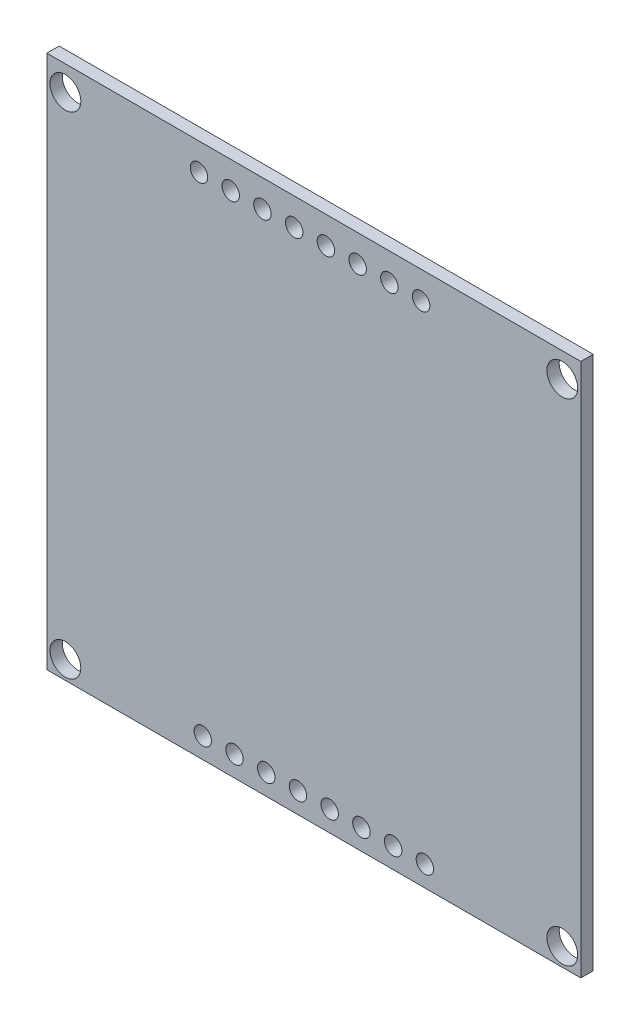
ISO-10303-21;
HEADER;
FILE_DESCRIPTION(('STEP AP214'),'2;1');
FILE_NAME('part.step','',(''),(''),'','','');
FILE_SCHEMA(('AUTOMOTIVE_DESIGN { 1 0 10303 214 1 1 1 1 }'));
ENDSEC;
DATA;
#1=APPLICATION_CONTEXT('core data for automotive mechanical design processes');
#2=APPLICATION_PROTOCOL_DEFINITION('international standard','automotive_design',2000,#1);
#3=PRODUCT_CONTEXT('',#1,'mechanical');
#4=PRODUCT('Part','Part','',(#3));
#5=PRODUCT_RELATED_PRODUCT_CATEGORY('part','',(#4));
#6=PRODUCT_DEFINITION_FORMATION('','',#4);
#7=PRODUCT_DEFINITION_CONTEXT('part definition',#1,'design');
#8=PRODUCT_DEFINITION('design','',#6,#7);
#9=PRODUCT_DEFINITION_SHAPE('','',#8);
#10=(LENGTH_UNIT() NAMED_UNIT(*) SI_UNIT(.MILLI.,.METRE.));
#11=(NAMED_UNIT(*) PLANE_ANGLE_UNIT() SI_UNIT($,.RADIAN.));
#12=(NAMED_UNIT(*) SI_UNIT($,.STERADIAN.) SOLID_ANGLE_UNIT());
#13=UNCERTAINTY_MEASURE_WITH_UNIT(LENGTH_MEASURE(1.E-05),#10,'distance_accuracy_value','');
#14=(GEOMETRIC_REPRESENTATION_CONTEXT(3) GLOBAL_UNCERTAINTY_ASSIGNED_CONTEXT((#13)) GLOBAL_UNIT_ASSIGNED_CONTEXT((#10,
#11,#12)) REPRESENTATION_CONTEXT('',''));
#15=CARTESIAN_POINT('',(0.,0.,0.));
#16=DIRECTION('',(0.,0.,1.));
#17=DIRECTION('',(1.,0.,0.));
#18=AXIS2_PLACEMENT_3D('',#15,#16,#17);
#19=CARTESIAN_POINT('',(0.,0.,1.));
#20=DIRECTION('',(0.,0.,-1.));
#21=DIRECTION('',(-1.,0.,0.));
#22=AXIS2_PLACEMENT_3D('',#19,#20,#21);
#23=PLANE('',#22);
#24=CARTESIAN_POINT('',(1.5,1.47673648000744,1.));
#25=DIRECTION('',(0.,0.,1.));
#26=DIRECTION('',(1.,0.,0.));
#27=AXIS2_PLACEMENT_3D('',#24,#25,#26);
#28=CIRCLE('',#27,1.25);
#29=CARTESIAN_POINT('',(2.75,1.47673648000744,1.));
#30=VERTEX_POINT('',#29);
#31=EDGE_CURVE('E218',#30,#30,#28,.T.);
#32=ORIENTED_EDGE('',*,*,#31,.F.);
#33=EDGE_LOOP('',(#32));
#34=FACE_BOUND('',#33,.T.);
#35=CARTESIAN_POINT('',(41.75,1.47673648000744,1.));
#36=DIRECTION('',(0.,0.,1.));
#37=DIRECTION('',(-1.,0.,0.));
#38=AXIS2_PLACEMENT_3D('',#35,#36,#37);
#39=CIRCLE('',#38,1.25);
#40=CARTESIAN_POINT('',(40.5,1.47673648000744,1.));
#41=VERTEX_POINT('',#40);
#42=EDGE_CURVE('E206',#41,#41,#39,.T.);
#43=ORIENTED_EDGE('',*,*,#42,.F.);
#44=EDGE_LOOP('',(#43));
#45=FACE_BOUND('',#44,.T.);
#46=CARTESIAN_POINT('',(20.34,1.67673648000722,1.));
#47=DIRECTION('',(0.,0.,1.));
#48=DIRECTION('',(-1.,0.,0.));
#49=AXIS2_PLACEMENT_3D('',#46,#47,#48);
#50=CIRCLE('',#49,0.707384328542562);
#51=CARTESIAN_POINT('',(19.6326156714574,1.67673648000722,1.));
#52=VERTEX_POINT('',#51);
#53=EDGE_CURVE('E194',#52,#52,#50,.T.);
#54=ORIENTED_EDGE('',*,*,#53,.F.);
#55=EDGE_LOOP('',(#54));
#56=FACE_BOUND('',#55,.T.);
#57=CARTESIAN_POINT('',(25.48,1.67673648000723,1.));
#58=DIRECTION('',(0.,0.,1.));
#59=DIRECTION('',(-1.,0.,0.));
#60=AXIS2_PLACEMENT_3D('',#57,#58,#59);
#61=CIRCLE('',#60,0.707384328542562);
#62=CARTESIAN_POINT('',(24.7726156714574,1.67673648000723,1.));
#63=VERTEX_POINT('',#62);
#64=EDGE_CURVE('E182',#63,#63,#61,.T.);
#65=ORIENTED_EDGE('',*,*,#64,.F.);
#66=EDGE_LOOP('',(#65));
#67=FACE_BOUND('',#66,.T.);
#68=CARTESIAN_POINT('',(30.62,1.67673648000723,1.));
#69=DIRECTION('',(0.,0.,1.));
#70=DIRECTION('',(-1.,0.,0.));
#71=AXIS2_PLACEMENT_3D('',#68,#69,#70);
#72=CIRCLE('',#71,0.707384328542566);
#73=CARTESIAN_POINT('',(29.9126156714574,1.67673648000723,1.));
#74=VERTEX_POINT('',#73);
#75=EDGE_CURVE('E170',#74,#74,#72,.T.);
#76=ORIENTED_EDGE('',*,*,#75,.F.);
#77=EDGE_LOOP('',(#76));
#78=FACE_BOUND('',#77,.T.);
#79=CARTESIAN_POINT('',(30.3125670065612,41.0314532498455,1.));
#80=DIRECTION('',(0.,0.,1.));
#81=DIRECTION('',(1.,0.,0.));
#82=AXIS2_PLACEMENT_3D('',#79,#80,#81);
#83=CIRCLE('',#82,0.707384328542565);
#84=CARTESIAN_POINT('',(31.0199513351037,41.0314532498455,1.));
#85=VERTEX_POINT('',#84);
#86=EDGE_CURVE('E158',#85,#85,#83,.T.);
#87=ORIENTED_EDGE('',*,*,#86,.F.);
#88=EDGE_LOOP('',(#87));
#89=FACE_BOUND('',#88,.T.);
#90=CARTESIAN_POINT('',(25.1725697380948,41.0367523213182,1.));
#91=DIRECTION('',(0.,0.,1.));
#92=DIRECTION('',(1.,0.,0.));
#93=AXIS2_PLACEMENT_3D('',#90,#91,#92);
#94=CIRCLE('',#93,0.707384328542558);
#95=CARTESIAN_POINT('',(25.8799540666374,41.0367523213182,1.));
#96=VERTEX_POINT('',#95);
#97=EDGE_CURVE('E146',#96,#96,#94,.T.);
#98=ORIENTED_EDGE('',*,*,#97,.F.);
#99=EDGE_LOOP('',(#98));
#100=FACE_BOUND('',#99,.T.);
#101=CARTESIAN_POINT('',(20.0325724696285,41.0420513927909,1.));
#102=DIRECTION('',(0.,0.,1.));
#103=DIRECTION('',(1.,0.,0.));
#104=AXIS2_PLACEMENT_3D('',#101,#102,#103);
#105=CIRCLE('',#104,0.707384328542558);
#106=CARTESIAN_POINT('',(20.739956798171,41.0420513927909,1.));
#107=VERTEX_POINT('',#106);
#108=EDGE_CURVE('E134',#107,#107,#105,.T.);
#109=ORIENTED_EDGE('',*,*,#108,.F.);
#110=EDGE_LOOP('',(#109));
#111=FACE_BOUND('',#110,.T.);
#112=CARTESIAN_POINT('',(14.8925752011621,41.0473504642636,1.));
#113=DIRECTION('',(0.,0.,1.));
#114=DIRECTION('',(1.,0.,0.));
#115=AXIS2_PLACEMENT_3D('',#112,#113,#114);
#116=CIRCLE('',#115,0.707384328542558);
#117=CARTESIAN_POINT('',(15.5999595297047,41.0473504642636,1.));
#118=VERTEX_POINT('',#117);
#119=EDGE_CURVE('E122',#118,#118,#116,.T.);
#120=ORIENTED_EDGE('',*,*,#119,.F.);
#121=EDGE_LOOP('',(#120));
#122=FACE_BOUND('',#121,.T.);
#123=CARTESIAN_POINT('',(12.3225765669289,41.05,1.));
#124=DIRECTION('',(0.,0.,1.));
#125=DIRECTION('',(1.,0.,0.));
#126=AXIS2_PLACEMENT_3D('',#123,#124,#125);
#127=CIRCLE('',#126,0.70738432854256);
#128=CARTESIAN_POINT('',(13.0299608954715,41.05,1.));
#129=VERTEX_POINT('',#128);
#130=EDGE_CURVE('E101',#129,#129,#127,.T.);
#131=ORIENTED_EDGE('',*,*,#130,.F.);
#132=EDGE_LOOP('',(#131));
#133=FACE_BOUND('',#132,.T.);
#134=DIRECTION('',(0.,-1.,0.));
#135=VECTOR('',#134,1.);
#136=CARTESIAN_POINT('',(0.,0.,1.));
#137=LINE('',#136,#135);
#138=CARTESIAN_POINT('',(0.,43.25,1.));
#139=VERTEX_POINT('',#138);
#140=CARTESIAN_POINT('',(0.,0.,1.));
#141=VERTEX_POINT('',#140);
#142=EDGE_CURVE('E86',#139,#141,#137,.T.);
#143=ORIENTED_EDGE('',*,*,#142,.T.);
#144=DIRECTION('',(1.,0.,0.));
#145=VECTOR('',#144,1.);
#146=CARTESIAN_POINT('',(0.,0.,1.));
#147=LINE('',#146,#145);
#148=CARTESIAN_POINT('',(43.25,0.,1.));
#149=VERTEX_POINT('',#148);
#150=EDGE_CURVE('E81',#141,#149,#147,.T.);
#151=ORIENTED_EDGE('',*,*,#150,.T.);
#152=DIRECTION('',(0.,1.,0.));
#153=VECTOR('',#152,1.);
#154=CARTESIAN_POINT('',(43.25,0.,1.));
#155=LINE('',#154,#153);
#156=CARTESIAN_POINT('',(43.25,43.25,1.));
#157=VERTEX_POINT('',#156);
#158=EDGE_CURVE('E84',#149,#157,#155,.T.);
#159=ORIENTED_EDGE('',*,*,#158,.T.);
#160=DIRECTION('',(-1.,0.,0.));
#161=VECTOR('',#160,1.);
#162=CARTESIAN_POINT('',(0.,43.25,1.));
#163=LINE('',#162,#161);
#164=EDGE_CURVE('E51',#157,#139,#163,.T.);
#165=ORIENTED_EDGE('',*,*,#164,.T.);
#166=EDGE_LOOP('',(#143,#151,#159,#165));
#167=FACE_BOUND('',#166,.T.);
#168=CARTESIAN_POINT('',(41.75,41.25,1.));
#169=DIRECTION('',(0.,0.,1.));
#170=DIRECTION('',(1.,0.,0.));
#171=AXIS2_PLACEMENT_3D('',#168,#169,#170);
#172=CIRCLE('',#171,1.25);
#173=CARTESIAN_POINT('',(43.,41.25,1.));
#174=VERTEX_POINT('',#173);
#175=EDGE_CURVE('E116',#174,#174,#172,.T.);
#176=ORIENTED_EDGE('',*,*,#175,.F.);
#177=EDGE_LOOP('',(#176));
#178=FACE_BOUND('',#177,.T.);
#179=CARTESIAN_POINT('',(17.4625738353953,41.0447009285273,1.));
#180=DIRECTION('',(0.,0.,1.));
#181=DIRECTION('',(1.,0.,0.));
#182=AXIS2_PLACEMENT_3D('',#179,#180,#181);
#183=CIRCLE('',#182,0.707384328542562);
#184=CARTESIAN_POINT('',(18.1699581639378,41.0447009285273,1.));
#185=VERTEX_POINT('',#184);
#186=EDGE_CURVE('E128',#185,#185,#183,.T.);
#187=ORIENTED_EDGE('',*,*,#186,.F.);
#188=EDGE_LOOP('',(#187));
#189=FACE_BOUND('',#188,.T.);
#190=CARTESIAN_POINT('',(22.6025711038616,41.0394018570546,1.));
#191=DIRECTION('',(0.,0.,1.));
#192=DIRECTION('',(1.,0.,0.));
#193=AXIS2_PLACEMENT_3D('',#190,#191,#192);
#194=CIRCLE('',#193,0.707384328542562);
#195=CARTESIAN_POINT('',(23.3099554324042,41.0394018570546,1.));
#196=VERTEX_POINT('',#195);
#197=EDGE_CURVE('E140',#196,#196,#194,.T.);
#198=ORIENTED_EDGE('',*,*,#197,.F.);
#199=EDGE_LOOP('',(#198));
#200=FACE_BOUND('',#199,.T.);
#201=CARTESIAN_POINT('',(27.742568372328,41.0341027855819,1.));
#202=DIRECTION('',(0.,0.,1.));
#203=DIRECTION('',(1.,0.,0.));
#204=AXIS2_PLACEMENT_3D('',#201,#202,#203);
#205=CIRCLE('',#204,0.707384328542558);
#206=CARTESIAN_POINT('',(28.4499527008705,41.0341027855819,1.));
#207=VERTEX_POINT('',#206);
#208=EDGE_CURVE('E152',#207,#207,#205,.T.);
#209=ORIENTED_EDGE('',*,*,#208,.F.);
#210=EDGE_LOOP('',(#209));
#211=FACE_BOUND('',#210,.T.);
#212=CARTESIAN_POINT('',(1.5,41.25,1.));
#213=DIRECTION('',(0.,0.,1.));
#214=DIRECTION('',(-1.,0.,0.));
#215=AXIS2_PLACEMENT_3D('',#212,#213,#214);
#216=CIRCLE('',#215,1.25);
#217=CARTESIAN_POINT('',(0.250000000000003,41.25,1.));
#218=VERTEX_POINT('',#217);
#219=EDGE_CURVE('E164',#218,#218,#216,.T.);
#220=ORIENTED_EDGE('',*,*,#219,.F.);
#221=EDGE_LOOP('',(#220));
#222=FACE_BOUND('',#221,.T.);
#223=CARTESIAN_POINT('',(28.05,1.67673648000723,1.));
#224=DIRECTION('',(0.,0.,1.));
#225=DIRECTION('',(-1.,0.,0.));
#226=AXIS2_PLACEMENT_3D('',#223,#224,#225);
#227=CIRCLE('',#226,0.707384328542562);
#228=CARTESIAN_POINT('',(27.3426156714574,1.67673648000723,1.));
#229=VERTEX_POINT('',#228);
#230=EDGE_CURVE('E176',#229,#229,#227,.T.);
#231=ORIENTED_EDGE('',*,*,#230,.F.);
#232=EDGE_LOOP('',(#231));
#233=FACE_BOUND('',#232,.T.);
#234=CARTESIAN_POINT('',(22.91,1.67673648000722,1.));
#235=DIRECTION('',(0.,0.,1.));
#236=DIRECTION('',(-1.,0.,0.));
#237=AXIS2_PLACEMENT_3D('',#234,#235,#236);
#238=CIRCLE('',#237,0.707384328542562);
#239=CARTESIAN_POINT('',(22.2026156714574,1.67673648000722,1.));
#240=VERTEX_POINT('',#239);
#241=EDGE_CURVE('E188',#240,#240,#238,.T.);
#242=ORIENTED_EDGE('',*,*,#241,.F.);
#243=EDGE_LOOP('',(#242));
#244=FACE_BOUND('',#243,.T.);
#245=CARTESIAN_POINT('',(17.77,1.67673648000722,1.));
#246=DIRECTION('',(0.,0.,1.));
#247=DIRECTION('',(-1.,0.,0.));
#248=AXIS2_PLACEMENT_3D('',#245,#246,#247);
#249=CIRCLE('',#248,0.707384328542562);
#250=CARTESIAN_POINT('',(17.0626156714574,1.67673648000722,1.));
#251=VERTEX_POINT('',#250);
#252=EDGE_CURVE('E200',#251,#251,#249,.T.);
#253=ORIENTED_EDGE('',*,*,#252,.F.);
#254=EDGE_LOOP('',(#253));
#255=FACE_BOUND('',#254,.T.);
#256=CARTESIAN_POINT('',(15.2,1.67673648000722,1.));
#257=DIRECTION('',(0.,0.,1.));
#258=DIRECTION('',(-1.,0.,0.));
#259=AXIS2_PLACEMENT_3D('',#256,#257,#258);
#260=CIRCLE('',#259,0.707384328542562);
#261=CARTESIAN_POINT('',(14.4926156714574,1.67673648000722,1.));
#262=VERTEX_POINT('',#261);
#263=EDGE_CURVE('E212',#262,#262,#260,.T.);
#264=ORIENTED_EDGE('',*,*,#263,.F.);
#265=EDGE_LOOP('',(#264));
#266=FACE_BOUND('',#265,.T.);
#267=CARTESIAN_POINT('',(12.63,1.67673648000723,1.));
#268=DIRECTION('',(0.,0.,1.));
#269=DIRECTION('',(-1.,0.,0.));
#270=AXIS2_PLACEMENT_3D('',#267,#268,#269);
#271=CIRCLE('',#270,0.707384328542562);
#272=CARTESIAN_POINT('',(11.9226156714574,1.67673648000723,1.));
#273=VERTEX_POINT('',#272);
#274=EDGE_CURVE('E224',#273,#273,#271,.T.);
#275=ORIENTED_EDGE('',*,*,#274,.F.);
#276=EDGE_LOOP('',(#275));
#277=FACE_BOUND('',#276,.T.);
#278=ADVANCED_FACE('F34',(#34,#45,#56,#67,#78,#89,#100,#111,#122,#133,#167,#178,#189,#200,#211,
#222,#233,#244,#255,#266,#277),#23,.F.);
#279=CARTESIAN_POINT('',(0.,0.,0.));
#280=DIRECTION('',(0.,0.,-1.));
#281=DIRECTION('',(-1.,0.,0.));
#282=AXIS2_PLACEMENT_3D('',#279,#280,#281);
#283=PLANE('',#282);
#284=CARTESIAN_POINT('',(1.5,1.47673648000744,0.));
#285=DIRECTION('',(0.,0.,1.));
#286=DIRECTION('',(1.,0.,0.));
#287=AXIS2_PLACEMENT_3D('',#284,#285,#286);
#288=CIRCLE('',#287,1.25);
#289=CARTESIAN_POINT('',(2.75,1.47673648000744,0.));
#290=VERTEX_POINT('',#289);
#291=EDGE_CURVE('E221',#290,#290,#288,.T.);
#292=ORIENTED_EDGE('',*,*,#291,.T.);
#293=EDGE_LOOP('',(#292));
#294=FACE_BOUND('',#293,.T.);
#295=CARTESIAN_POINT('',(41.75,1.47673648000744,0.));
#296=DIRECTION('',(0.,0.,1.));
#297=DIRECTION('',(-1.,0.,0.));
#298=AXIS2_PLACEMENT_3D('',#295,#296,#297);
#299=CIRCLE('',#298,1.25);
#300=CARTESIAN_POINT('',(40.5,1.47673648000744,0.));
#301=VERTEX_POINT('',#300);
#302=EDGE_CURVE('E209',#301,#301,#299,.T.);
#303=ORIENTED_EDGE('',*,*,#302,.T.);
#304=EDGE_LOOP('',(#303));
#305=FACE_BOUND('',#304,.T.);
#306=CARTESIAN_POINT('',(20.34,1.67673648000722,0.));
#307=DIRECTION('',(0.,0.,1.));
#308=DIRECTION('',(-1.,0.,0.));
#309=AXIS2_PLACEMENT_3D('',#306,#307,#308);
#310=CIRCLE('',#309,0.707384328542562);
#311=CARTESIAN_POINT('',(19.6326156714574,1.67673648000722,0.));
#312=VERTEX_POINT('',#311);
#313=EDGE_CURVE('E197',#312,#312,#310,.T.);
#314=ORIENTED_EDGE('',*,*,#313,.T.);
#315=EDGE_LOOP('',(#314));
#316=FACE_BOUND('',#315,.T.);
#317=CARTESIAN_POINT('',(25.48,1.67673648000723,0.));
#318=DIRECTION('',(0.,0.,1.));
#319=DIRECTION('',(-1.,0.,0.));
#320=AXIS2_PLACEMENT_3D('',#317,#318,#319);
#321=CIRCLE('',#320,0.707384328542562);
#322=CARTESIAN_POINT('',(24.7726156714574,1.67673648000723,0.));
#323=VERTEX_POINT('',#322);
#324=EDGE_CURVE('E185',#323,#323,#321,.T.);
#325=ORIENTED_EDGE('',*,*,#324,.T.);
#326=EDGE_LOOP('',(#325));
#327=FACE_BOUND('',#326,.T.);
#328=CARTESIAN_POINT('',(30.62,1.67673648000723,0.));
#329=DIRECTION('',(0.,0.,1.));
#330=DIRECTION('',(-1.,0.,0.));
#331=AXIS2_PLACEMENT_3D('',#328,#329,#330);
#332=CIRCLE('',#331,0.707384328542566);
#333=CARTESIAN_POINT('',(29.9126156714574,1.67673648000723,0.));
#334=VERTEX_POINT('',#333);
#335=EDGE_CURVE('E173',#334,#334,#332,.T.);
#336=ORIENTED_EDGE('',*,*,#335,.T.);
#337=EDGE_LOOP('',(#336));
#338=FACE_BOUND('',#337,.T.);
#339=CARTESIAN_POINT('',(30.3125670065612,41.0314532498455,0.));
#340=DIRECTION('',(0.,0.,1.));
#341=DIRECTION('',(1.,0.,0.));
#342=AXIS2_PLACEMENT_3D('',#339,#340,#341);
#343=CIRCLE('',#342,0.707384328542565);
#344=CARTESIAN_POINT('',(31.0199513351037,41.0314532498455,0.));
#345=VERTEX_POINT('',#344);
#346=EDGE_CURVE('E161',#345,#345,#343,.T.);
#347=ORIENTED_EDGE('',*,*,#346,.T.);
#348=EDGE_LOOP('',(#347));
#349=FACE_BOUND('',#348,.T.);
#350=CARTESIAN_POINT('',(25.1725697380948,41.0367523213182,0.));
#351=DIRECTION('',(0.,0.,1.));
#352=DIRECTION('',(1.,0.,0.));
#353=AXIS2_PLACEMENT_3D('',#350,#351,#352);
#354=CIRCLE('',#353,0.707384328542558);
#355=CARTESIAN_POINT('',(25.8799540666374,41.0367523213182,0.));
#356=VERTEX_POINT('',#355);
#357=EDGE_CURVE('E149',#356,#356,#354,.T.);
#358=ORIENTED_EDGE('',*,*,#357,.T.);
#359=EDGE_LOOP('',(#358));
#360=FACE_BOUND('',#359,.T.);
#361=CARTESIAN_POINT('',(20.0325724696285,41.0420513927909,0.));
#362=DIRECTION('',(0.,0.,1.));
#363=DIRECTION('',(1.,0.,0.));
#364=AXIS2_PLACEMENT_3D('',#361,#362,#363);
#365=CIRCLE('',#364,0.707384328542558);
#366=CARTESIAN_POINT('',(20.739956798171,41.0420513927909,0.));
#367=VERTEX_POINT('',#366);
#368=EDGE_CURVE('E137',#367,#367,#365,.T.);
#369=ORIENTED_EDGE('',*,*,#368,.T.);
#370=EDGE_LOOP('',(#369));
#371=FACE_BOUND('',#370,.T.);
#372=CARTESIAN_POINT('',(14.8925752011621,41.0473504642636,0.));
#373=DIRECTION('',(0.,0.,1.));
#374=DIRECTION('',(1.,0.,0.));
#375=AXIS2_PLACEMENT_3D('',#372,#373,#374);
#376=CIRCLE('',#375,0.707384328542558);
#377=CARTESIAN_POINT('',(15.5999595297047,41.0473504642636,0.));
#378=VERTEX_POINT('',#377);
#379=EDGE_CURVE('E125',#378,#378,#376,.T.);
#380=ORIENTED_EDGE('',*,*,#379,.T.);
#381=EDGE_LOOP('',(#380));
#382=FACE_BOUND('',#381,.T.);
#383=CARTESIAN_POINT('',(12.3225765669289,41.05,0.));
#384=DIRECTION('',(0.,0.,1.));
#385=DIRECTION('',(1.,0.,0.));
#386=AXIS2_PLACEMENT_3D('',#383,#384,#385);
#387=CIRCLE('',#386,0.70738432854256);
#388=CARTESIAN_POINT('',(13.0299608954715,41.05,0.));
#389=VERTEX_POINT('',#388);
#390=EDGE_CURVE('E113',#389,#389,#387,.T.);
#391=ORIENTED_EDGE('',*,*,#390,.T.);
#392=EDGE_LOOP('',(#391));
#393=FACE_BOUND('',#392,.T.);
#394=DIRECTION('',(0.,-1.,0.));
#395=VECTOR('',#394,1.);
#396=CARTESIAN_POINT('',(0.,0.,0.));
#397=LINE('',#396,#395);
#398=CARTESIAN_POINT('',(0.,43.25,0.));
#399=VERTEX_POINT('',#398);
#400=CARTESIAN_POINT('',(0.,0.,0.));
#401=VERTEX_POINT('',#400);
#402=EDGE_CURVE('E98',#399,#401,#397,.T.);
#403=ORIENTED_EDGE('',*,*,#402,.F.);
#404=DIRECTION('',(-1.,0.,0.));
#405=VECTOR('',#404,1.);
#406=CARTESIAN_POINT('',(0.,43.25,0.));
#407=LINE('',#406,#405);
#408=CARTESIAN_POINT('',(43.25,43.25,0.));
#409=VERTEX_POINT('',#408);
#410=EDGE_CURVE('E74',#409,#399,#407,.T.);
#411=ORIENTED_EDGE('',*,*,#410,.F.);
#412=DIRECTION('',(0.,1.,0.));
#413=VECTOR('',#412,1.);
#414=CARTESIAN_POINT('',(43.25,0.,0.));
#415=LINE('',#414,#413);
#416=CARTESIAN_POINT('',(43.25,0.,0.));
#417=VERTEX_POINT('',#416);
#418=EDGE_CURVE('E68',#417,#409,#415,.T.);
#419=ORIENTED_EDGE('',*,*,#418,.F.);
#420=DIRECTION('',(1.,0.,0.));
#421=VECTOR('',#420,1.);
#422=CARTESIAN_POINT('',(0.,0.,0.));
#423=LINE('',#422,#421);
#424=EDGE_CURVE('E90',#401,#417,#423,.T.);
#425=ORIENTED_EDGE('',*,*,#424,.F.);
#426=EDGE_LOOP('',(#403,#411,#419,#425));
#427=FACE_BOUND('',#426,.T.);
#428=CARTESIAN_POINT('',(41.75,41.25,0.));
#429=DIRECTION('',(0.,0.,1.));
#430=DIRECTION('',(1.,0.,0.));
#431=AXIS2_PLACEMENT_3D('',#428,#429,#430);
#432=CIRCLE('',#431,1.25);
#433=CARTESIAN_POINT('',(43.,41.25,0.));
#434=VERTEX_POINT('',#433);
#435=EDGE_CURVE('E119',#434,#434,#432,.T.);
#436=ORIENTED_EDGE('',*,*,#435,.T.);
#437=EDGE_LOOP('',(#436));
#438=FACE_BOUND('',#437,.T.);
#439=CARTESIAN_POINT('',(17.4625738353953,41.0447009285273,0.));
#440=DIRECTION('',(0.,0.,1.));
#441=DIRECTION('',(1.,0.,0.));
#442=AXIS2_PLACEMENT_3D('',#439,#440,#441);
#443=CIRCLE('',#442,0.707384328542562);
#444=CARTESIAN_POINT('',(18.1699581639378,41.0447009285273,0.));
#445=VERTEX_POINT('',#444);
#446=EDGE_CURVE('E131',#445,#445,#443,.T.);
#447=ORIENTED_EDGE('',*,*,#446,.T.);
#448=EDGE_LOOP('',(#447));
#449=FACE_BOUND('',#448,.T.);
#450=CARTESIAN_POINT('',(22.6025711038616,41.0394018570546,0.));
#451=DIRECTION('',(0.,0.,1.));
#452=DIRECTION('',(1.,0.,0.));
#453=AXIS2_PLACEMENT_3D('',#450,#451,#452);
#454=CIRCLE('',#453,0.707384328542562);
#455=CARTESIAN_POINT('',(23.3099554324042,41.0394018570546,0.));
#456=VERTEX_POINT('',#455);
#457=EDGE_CURVE('E143',#456,#456,#454,.T.);
#458=ORIENTED_EDGE('',*,*,#457,.T.);
#459=EDGE_LOOP('',(#458));
#460=FACE_BOUND('',#459,.T.);
#461=CARTESIAN_POINT('',(27.742568372328,41.0341027855819,0.));
#462=DIRECTION('',(0.,0.,1.));
#463=DIRECTION('',(1.,0.,0.));
#464=AXIS2_PLACEMENT_3D('',#461,#462,#463);
#465=CIRCLE('',#464,0.707384328542558);
#466=CARTESIAN_POINT('',(28.4499527008705,41.0341027855819,0.));
#467=VERTEX_POINT('',#466);
#468=EDGE_CURVE('E155',#467,#467,#465,.T.);
#469=ORIENTED_EDGE('',*,*,#468,.T.);
#470=EDGE_LOOP('',(#469));
#471=FACE_BOUND('',#470,.T.);
#472=CARTESIAN_POINT('',(1.5,41.25,0.));
#473=DIRECTION('',(0.,0.,1.));
#474=DIRECTION('',(-1.,0.,0.));
#475=AXIS2_PLACEMENT_3D('',#472,#473,#474);
#476=CIRCLE('',#475,1.25);
#477=CARTESIAN_POINT('',(0.250000000000003,41.25,0.));
#478=VERTEX_POINT('',#477);
#479=EDGE_CURVE('E167',#478,#478,#476,.T.);
#480=ORIENTED_EDGE('',*,*,#479,.T.);
#481=EDGE_LOOP('',(#480));
#482=FACE_BOUND('',#481,.T.);
#483=CARTESIAN_POINT('',(28.05,1.67673648000723,0.));
#484=DIRECTION('',(0.,0.,1.));
#485=DIRECTION('',(-1.,0.,0.));
#486=AXIS2_PLACEMENT_3D('',#483,#484,#485);
#487=CIRCLE('',#486,0.707384328542562);
#488=CARTESIAN_POINT('',(27.3426156714574,1.67673648000723,0.));
#489=VERTEX_POINT('',#488);
#490=EDGE_CURVE('E179',#489,#489,#487,.T.);
#491=ORIENTED_EDGE('',*,*,#490,.T.);
#492=EDGE_LOOP('',(#491));
#493=FACE_BOUND('',#492,.T.);
#494=CARTESIAN_POINT('',(22.91,1.67673648000722,0.));
#495=DIRECTION('',(0.,0.,1.));
#496=DIRECTION('',(-1.,0.,0.));
#497=AXIS2_PLACEMENT_3D('',#494,#495,#496);
#498=CIRCLE('',#497,0.707384328542562);
#499=CARTESIAN_POINT('',(22.2026156714574,1.67673648000722,0.));
#500=VERTEX_POINT('',#499);
#501=EDGE_CURVE('E191',#500,#500,#498,.T.);
#502=ORIENTED_EDGE('',*,*,#501,.T.);
#503=EDGE_LOOP('',(#502));
#504=FACE_BOUND('',#503,.T.);
#505=CARTESIAN_POINT('',(17.77,1.67673648000722,0.));
#506=DIRECTION('',(0.,0.,1.));
#507=DIRECTION('',(-1.,0.,0.));
#508=AXIS2_PLACEMENT_3D('',#505,#506,#507);
#509=CIRCLE('',#508,0.707384328542562);
#510=CARTESIAN_POINT('',(17.0626156714574,1.67673648000722,0.));
#511=VERTEX_POINT('',#510);
#512=EDGE_CURVE('E203',#511,#511,#509,.T.);
#513=ORIENTED_EDGE('',*,*,#512,.T.);
#514=EDGE_LOOP('',(#513));
#515=FACE_BOUND('',#514,.T.);
#516=CARTESIAN_POINT('',(15.2,1.67673648000722,0.));
#517=DIRECTION('',(0.,0.,1.));
#518=DIRECTION('',(-1.,0.,0.));
#519=AXIS2_PLACEMENT_3D('',#516,#517,#518);
#520=CIRCLE('',#519,0.707384328542562);
#521=CARTESIAN_POINT('',(14.4926156714574,1.67673648000722,0.));
#522=VERTEX_POINT('',#521);
#523=EDGE_CURVE('E215',#522,#522,#520,.T.);
#524=ORIENTED_EDGE('',*,*,#523,.T.);
#525=EDGE_LOOP('',(#524));
#526=FACE_BOUND('',#525,.T.);
#527=CARTESIAN_POINT('',(12.63,1.67673648000723,0.));
#528=DIRECTION('',(0.,0.,1.));
#529=DIRECTION('',(-1.,0.,0.));
#530=AXIS2_PLACEMENT_3D('',#527,#528,#529);
#531=CIRCLE('',#530,0.707384328542562);
#532=CARTESIAN_POINT('',(11.9226156714574,1.67673648000723,0.));
#533=VERTEX_POINT('',#532);
#534=EDGE_CURVE('E227',#533,#533,#531,.T.);
#535=ORIENTED_EDGE('',*,*,#534,.T.);
#536=EDGE_LOOP('',(#535));
#537=FACE_BOUND('',#536,.T.);
#538=ADVANCED_FACE('F109',(#294,#305,#316,#327,#338,#349,#360,#371,#382,#393,#427,#438,#449,
#460,#471,#482,#493,#504,#515,#526,#537),#283,.T.);
#539=CARTESIAN_POINT('',(0.,0.,1.));
#540=DIRECTION('',(1.,0.,0.));
#541=DIRECTION('',(0.,0.,-1.));
#542=AXIS2_PLACEMENT_3D('',#539,#540,#541);
#543=PLANE('',#542);
#544=ORIENTED_EDGE('',*,*,#402,.T.);
#545=DIRECTION('',(0.,0.,-1.));
#546=VECTOR('',#545,1.);
#547=CARTESIAN_POINT('',(0.,0.,1.));
#548=LINE('',#547,#546);
#549=EDGE_CURVE('E11',#141,#401,#548,.T.);
#550=ORIENTED_EDGE('',*,*,#549,.F.);
#551=ORIENTED_EDGE('',*,*,#142,.F.);
#552=DIRECTION('',(0.,0.,-1.));
#553=VECTOR('',#552,1.);
#554=CARTESIAN_POINT('',(0.,43.25,1.));
#555=LINE('',#554,#553);
#556=EDGE_CURVE('E94',#139,#399,#555,.T.);
#557=ORIENTED_EDGE('',*,*,#556,.T.);
#558=EDGE_LOOP('',(#544,#550,#551,#557));
#559=FACE_BOUND('',#558,.T.);
#560=ADVANCED_FACE('F36',(#559),#543,.F.);
#561=CARTESIAN_POINT('',(0.,0.,1.));
#562=DIRECTION('',(0.,1.,0.));
#563=DIRECTION('',(0.,0.,1.));
#564=AXIS2_PLACEMENT_3D('',#561,#562,#563);
#565=PLANE('',#564);
#566=ORIENTED_EDGE('',*,*,#424,.T.);
#567=DIRECTION('',(0.,0.,-1.));
#568=VECTOR('',#567,1.);
#569=CARTESIAN_POINT('',(43.25,0.,1.));
#570=LINE('',#569,#568);
#571=EDGE_CURVE('E43',#149,#417,#570,.T.);
#572=ORIENTED_EDGE('',*,*,#571,.F.);
#573=ORIENTED_EDGE('',*,*,#150,.F.);
#574=ORIENTED_EDGE('',*,*,#549,.T.);
#575=EDGE_LOOP('',(#566,#572,#573,#574));
#576=FACE_BOUND('',#575,.T.);
#577=ADVANCED_FACE('F89',(#576),#565,.F.);
#578=CARTESIAN_POINT('',(43.25,0.,1.));
#579=DIRECTION('',(-1.,0.,0.));
#580=DIRECTION('',(0.,0.,1.));
#581=AXIS2_PLACEMENT_3D('',#578,#579,#580);
#582=PLANE('',#581);
#583=ORIENTED_EDGE('',*,*,#418,.T.);
#584=DIRECTION('',(0.,0.,-1.));
#585=VECTOR('',#584,1.);
#586=CARTESIAN_POINT('',(43.25,43.25,1.));
#587=LINE('',#586,#585);
#588=EDGE_CURVE('E91',#157,#409,#587,.T.);
#589=ORIENTED_EDGE('',*,*,#588,.F.);
#590=ORIENTED_EDGE('',*,*,#158,.F.);
#591=ORIENTED_EDGE('',*,*,#571,.T.);
#592=EDGE_LOOP('',(#583,#589,#590,#591));
#593=FACE_BOUND('',#592,.T.);
#594=ADVANCED_FACE('F92',(#593),#582,.F.);
#595=CARTESIAN_POINT('',(0.,43.25,1.));
#596=DIRECTION('',(0.,-1.,0.));
#597=DIRECTION('',(0.,0.,-1.));
#598=AXIS2_PLACEMENT_3D('',#595,#596,#597);
#599=PLANE('',#598);
#600=ORIENTED_EDGE('',*,*,#410,.T.);
#601=ORIENTED_EDGE('',*,*,#556,.F.);
#602=ORIENTED_EDGE('',*,*,#164,.F.);
#603=ORIENTED_EDGE('',*,*,#588,.T.);
#604=EDGE_LOOP('',(#600,#601,#602,#603));
#605=FACE_BOUND('',#604,.T.);
#606=ADVANCED_FACE('F106',(#605),#599,.F.);
#607=CARTESIAN_POINT('',(12.3225765669289,41.05,1.));
#608=DIRECTION('',(0.,0.,-1.));
#609=DIRECTION('',(-1.,0.,0.));
#610=AXIS2_PLACEMENT_3D('',#607,#608,#609);
#611=CYLINDRICAL_SURFACE('',#610,0.70738432854256);
#612=ORIENTED_EDGE('',*,*,#130,.T.);
#613=EDGE_LOOP('',(#612));
#614=FACE_BOUND('',#613,.T.);
#615=ORIENTED_EDGE('',*,*,#390,.F.);
#616=EDGE_LOOP('',(#615));
#617=FACE_BOUND('',#616,.T.);
#618=ADVANCED_FACE('F247',(#614,#617),#611,.F.);
#619=CARTESIAN_POINT('',(41.75,41.25,1.));
#620=DIRECTION('',(0.,0.,-1.));
#621=DIRECTION('',(-1.,0.,0.));
#622=AXIS2_PLACEMENT_3D('',#619,#620,#621);
#623=CYLINDRICAL_SURFACE('',#622,1.25);
#624=ORIENTED_EDGE('',*,*,#175,.T.);
#625=EDGE_LOOP('',(#624));
#626=FACE_BOUND('',#625,.T.);
#627=ORIENTED_EDGE('',*,*,#435,.F.);
#628=EDGE_LOOP('',(#627));
#629=FACE_BOUND('',#628,.T.);
#630=ADVANCED_FACE('F302',(#626,#629),#623,.F.);
#631=CARTESIAN_POINT('',(14.8925752011621,41.0473504642636,1.));
#632=DIRECTION('',(0.,0.,-1.));
#633=DIRECTION('',(-1.,0.,0.));
#634=AXIS2_PLACEMENT_3D('',#631,#632,#633);
#635=CYLINDRICAL_SURFACE('',#634,0.707384328542558);
#636=ORIENTED_EDGE('',*,*,#119,.T.);
#637=EDGE_LOOP('',(#636));
#638=FACE_BOUND('',#637,.T.);
#639=ORIENTED_EDGE('',*,*,#379,.F.);
#640=EDGE_LOOP('',(#639));
#641=FACE_BOUND('',#640,.T.);
#642=ADVANCED_FACE('F310',(#638,#641),#635,.F.);
#643=CARTESIAN_POINT('',(17.4625738353953,41.0447009285273,1.));
#644=DIRECTION('',(0.,0.,-1.));
#645=DIRECTION('',(-1.,0.,0.));
#646=AXIS2_PLACEMENT_3D('',#643,#644,#645);
#647=CYLINDRICAL_SURFACE('',#646,0.707384328542562);
#648=ORIENTED_EDGE('',*,*,#186,.T.);
#649=EDGE_LOOP('',(#648));
#650=FACE_BOUND('',#649,.T.);
#651=ORIENTED_EDGE('',*,*,#446,.F.);
#652=EDGE_LOOP('',(#651));
#653=FACE_BOUND('',#652,.T.);
#654=ADVANCED_FACE('F318',(#650,#653),#647,.F.);
#655=CARTESIAN_POINT('',(20.0325724696285,41.0420513927909,1.));
#656=DIRECTION('',(0.,0.,-1.));
#657=DIRECTION('',(-1.,0.,0.));
#658=AXIS2_PLACEMENT_3D('',#655,#656,#657);
#659=CYLINDRICAL_SURFACE('',#658,0.707384328542558);
#660=ORIENTED_EDGE('',*,*,#108,.T.);
#661=EDGE_LOOP('',(#660));
#662=FACE_BOUND('',#661,.T.);
#663=ORIENTED_EDGE('',*,*,#368,.F.);
#664=EDGE_LOOP('',(#663));
#665=FACE_BOUND('',#664,.T.);
#666=ADVANCED_FACE('F327',(#662,#665),#659,.F.);
#667=CARTESIAN_POINT('',(22.6025711038616,41.0394018570546,1.));
#668=DIRECTION('',(0.,0.,-1.));
#669=DIRECTION('',(-1.,0.,0.));
#670=AXIS2_PLACEMENT_3D('',#667,#668,#669);
#671=CYLINDRICAL_SURFACE('',#670,0.707384328542562);
#672=ORIENTED_EDGE('',*,*,#197,.T.);
#673=EDGE_LOOP('',(#672));
#674=FACE_BOUND('',#673,.T.);
#675=ORIENTED_EDGE('',*,*,#457,.F.);
#676=EDGE_LOOP('',(#675));
#677=FACE_BOUND('',#676,.T.);
#678=ADVANCED_FACE('F336',(#674,#677),#671,.F.);
#679=CARTESIAN_POINT('',(25.1725697380948,41.0367523213182,1.));
#680=DIRECTION('',(0.,0.,-1.));
#681=DIRECTION('',(-1.,0.,0.));
#682=AXIS2_PLACEMENT_3D('',#679,#680,#681);
#683=CYLINDRICAL_SURFACE('',#682,0.707384328542558);
#684=ORIENTED_EDGE('',*,*,#97,.T.);
#685=EDGE_LOOP('',(#684));
#686=FACE_BOUND('',#685,.T.);
#687=ORIENTED_EDGE('',*,*,#357,.F.);
#688=EDGE_LOOP('',(#687));
#689=FACE_BOUND('',#688,.T.);
#690=ADVANCED_FACE('F345',(#686,#689),#683,.F.);
#691=CARTESIAN_POINT('',(27.742568372328,41.0341027855819,1.));
#692=DIRECTION('',(0.,0.,-1.));
#693=DIRECTION('',(-1.,0.,0.));
#694=AXIS2_PLACEMENT_3D('',#691,#692,#693);
#695=CYLINDRICAL_SURFACE('',#694,0.707384328542558);
#696=ORIENTED_EDGE('',*,*,#208,.T.);
#697=EDGE_LOOP('',(#696));
#698=FACE_BOUND('',#697,.T.);
#699=ORIENTED_EDGE('',*,*,#468,.F.);
#700=EDGE_LOOP('',(#699));
#701=FACE_BOUND('',#700,.T.);
#702=ADVANCED_FACE('F354',(#698,#701),#695,.F.);
#703=CARTESIAN_POINT('',(30.3125670065612,41.0314532498455,1.));
#704=DIRECTION('',(0.,0.,-1.));
#705=DIRECTION('',(-1.,0.,0.));
#706=AXIS2_PLACEMENT_3D('',#703,#704,#705);
#707=CYLINDRICAL_SURFACE('',#706,0.707384328542565);
#708=ORIENTED_EDGE('',*,*,#86,.T.);
#709=EDGE_LOOP('',(#708));
#710=FACE_BOUND('',#709,.T.);
#711=ORIENTED_EDGE('',*,*,#346,.F.);
#712=EDGE_LOOP('',(#711));
#713=FACE_BOUND('',#712,.T.);
#714=ADVANCED_FACE('F363',(#710,#713),#707,.F.);
#715=CARTESIAN_POINT('',(1.5,41.25,1.));
#716=DIRECTION('',(0.,0.,-1.));
#717=DIRECTION('',(-1.,0.,0.));
#718=AXIS2_PLACEMENT_3D('',#715,#716,#717);
#719=CYLINDRICAL_SURFACE('',#718,1.25);
#720=ORIENTED_EDGE('',*,*,#219,.T.);
#721=EDGE_LOOP('',(#720));
#722=FACE_BOUND('',#721,.T.);
#723=ORIENTED_EDGE('',*,*,#479,.F.);
#724=EDGE_LOOP('',(#723));
#725=FACE_BOUND('',#724,.T.);
#726=ADVANCED_FACE('F372',(#722,#725),#719,.F.);
#727=CARTESIAN_POINT('',(30.62,1.67673648000723,1.));
#728=DIRECTION('',(0.,0.,-1.));
#729=DIRECTION('',(-1.,0.,0.));
#730=AXIS2_PLACEMENT_3D('',#727,#728,#729);
#731=CYLINDRICAL_SURFACE('',#730,0.707384328542566);
#732=ORIENTED_EDGE('',*,*,#75,.T.);
#733=EDGE_LOOP('',(#732));
#734=FACE_BOUND('',#733,.T.);
#735=ORIENTED_EDGE('',*,*,#335,.F.);
#736=EDGE_LOOP('',(#735));
#737=FACE_BOUND('',#736,.T.);
#738=ADVANCED_FACE('F381',(#734,#737),#731,.F.);
#739=CARTESIAN_POINT('',(28.05,1.67673648000723,1.));
#740=DIRECTION('',(0.,0.,-1.));
#741=DIRECTION('',(-1.,0.,0.));
#742=AXIS2_PLACEMENT_3D('',#739,#740,#741);
#743=CYLINDRICAL_SURFACE('',#742,0.707384328542562);
#744=ORIENTED_EDGE('',*,*,#230,.T.);
#745=EDGE_LOOP('',(#744));
#746=FACE_BOUND('',#745,.T.);
#747=ORIENTED_EDGE('',*,*,#490,.F.);
#748=EDGE_LOOP('',(#747));
#749=FACE_BOUND('',#748,.T.);
#750=ADVANCED_FACE('F390',(#746,#749),#743,.F.);
#751=CARTESIAN_POINT('',(25.48,1.67673648000723,1.));
#752=DIRECTION('',(0.,0.,-1.));
#753=DIRECTION('',(-1.,0.,0.));
#754=AXIS2_PLACEMENT_3D('',#751,#752,#753);
#755=CYLINDRICAL_SURFACE('',#754,0.707384328542562);
#756=ORIENTED_EDGE('',*,*,#64,.T.);
#757=EDGE_LOOP('',(#756));
#758=FACE_BOUND('',#757,.T.);
#759=ORIENTED_EDGE('',*,*,#324,.F.);
#760=EDGE_LOOP('',(#759));
#761=FACE_BOUND('',#760,.T.);
#762=ADVANCED_FACE('F399',(#758,#761),#755,.F.);
#763=CARTESIAN_POINT('',(22.91,1.67673648000722,1.));
#764=DIRECTION('',(0.,0.,-1.));
#765=DIRECTION('',(-1.,0.,0.));
#766=AXIS2_PLACEMENT_3D('',#763,#764,#765);
#767=CYLINDRICAL_SURFACE('',#766,0.707384328542562);
#768=ORIENTED_EDGE('',*,*,#241,.T.);
#769=EDGE_LOOP('',(#768));
#770=FACE_BOUND('',#769,.T.);
#771=ORIENTED_EDGE('',*,*,#501,.F.);
#772=EDGE_LOOP('',(#771));
#773=FACE_BOUND('',#772,.T.);
#774=ADVANCED_FACE('F408',(#770,#773),#767,.F.);
#775=CARTESIAN_POINT('',(20.34,1.67673648000722,1.));
#776=DIRECTION('',(0.,0.,-1.));
#777=DIRECTION('',(-1.,0.,0.));
#778=AXIS2_PLACEMENT_3D('',#775,#776,#777);
#779=CYLINDRICAL_SURFACE('',#778,0.707384328542562);
#780=ORIENTED_EDGE('',*,*,#53,.T.);
#781=EDGE_LOOP('',(#780));
#782=FACE_BOUND('',#781,.T.);
#783=ORIENTED_EDGE('',*,*,#313,.F.);
#784=EDGE_LOOP('',(#783));
#785=FACE_BOUND('',#784,.T.);
#786=ADVANCED_FACE('F417',(#782,#785),#779,.F.);
#787=CARTESIAN_POINT('',(17.77,1.67673648000722,1.));
#788=DIRECTION('',(0.,0.,-1.));
#789=DIRECTION('',(-1.,0.,0.));
#790=AXIS2_PLACEMENT_3D('',#787,#788,#789);
#791=CYLINDRICAL_SURFACE('',#790,0.707384328542562);
#792=ORIENTED_EDGE('',*,*,#252,.T.);
#793=EDGE_LOOP('',(#792));
#794=FACE_BOUND('',#793,.T.);
#795=ORIENTED_EDGE('',*,*,#512,.F.);
#796=EDGE_LOOP('',(#795));
#797=FACE_BOUND('',#796,.T.);
#798=ADVANCED_FACE('F426',(#794,#797),#791,.F.);
#799=CARTESIAN_POINT('',(41.75,1.47673648000744,1.));
#800=DIRECTION('',(0.,0.,-1.));
#801=DIRECTION('',(-1.,0.,0.));
#802=AXIS2_PLACEMENT_3D('',#799,#800,#801);
#803=CYLINDRICAL_SURFACE('',#802,1.25);
#804=ORIENTED_EDGE('',*,*,#42,.T.);
#805=EDGE_LOOP('',(#804));
#806=FACE_BOUND('',#805,.T.);
#807=ORIENTED_EDGE('',*,*,#302,.F.);
#808=EDGE_LOOP('',(#807));
#809=FACE_BOUND('',#808,.T.);
#810=ADVANCED_FACE('F435',(#806,#809),#803,.F.);
#811=CARTESIAN_POINT('',(15.2,1.67673648000722,1.));
#812=DIRECTION('',(0.,0.,-1.));
#813=DIRECTION('',(-1.,0.,0.));
#814=AXIS2_PLACEMENT_3D('',#811,#812,#813);
#815=CYLINDRICAL_SURFACE('',#814,0.707384328542562);
#816=ORIENTED_EDGE('',*,*,#263,.T.);
#817=EDGE_LOOP('',(#816));
#818=FACE_BOUND('',#817,.T.);
#819=ORIENTED_EDGE('',*,*,#523,.F.);
#820=EDGE_LOOP('',(#819));
#821=FACE_BOUND('',#820,.T.);
#822=ADVANCED_FACE('F444',(#818,#821),#815,.F.);
#823=CARTESIAN_POINT('',(1.5,1.47673648000744,1.));
#824=DIRECTION('',(0.,0.,-1.));
#825=DIRECTION('',(-1.,0.,0.));
#826=AXIS2_PLACEMENT_3D('',#823,#824,#825);
#827=CYLINDRICAL_SURFACE('',#826,1.25);
#828=ORIENTED_EDGE('',*,*,#31,.T.);
#829=EDGE_LOOP('',(#828));
#830=FACE_BOUND('',#829,.T.);
#831=ORIENTED_EDGE('',*,*,#291,.F.);
#832=EDGE_LOOP('',(#831));
#833=FACE_BOUND('',#832,.T.);
#834=ADVANCED_FACE('F453',(#830,#833),#827,.F.);
#835=CARTESIAN_POINT('',(12.63,1.67673648000723,1.));
#836=DIRECTION('',(0.,0.,-1.));
#837=DIRECTION('',(-1.,0.,0.));
#838=AXIS2_PLACEMENT_3D('',#835,#836,#837);
#839=CYLINDRICAL_SURFACE('',#838,0.707384328542562);
#840=ORIENTED_EDGE('',*,*,#274,.T.);
#841=EDGE_LOOP('',(#840));
#842=FACE_BOUND('',#841,.T.);
#843=ORIENTED_EDGE('',*,*,#534,.F.);
#844=EDGE_LOOP('',(#843));
#845=FACE_BOUND('',#844,.T.);
#846=ADVANCED_FACE('F233',(#842,#845),#839,.F.);
#847=CLOSED_SHELL('',(#278,#538,#560,#577,#594,#606,#618,#630,#642,#654,#666,#678,#690,#702,
#714,#726,#738,#750,#762,#774,#786,#798,#810,#822,#834,#846));
#848=MANIFOLD_SOLID_BREP('B2',#847);
#849=ADVANCED_BREP_SHAPE_REPRESENTATION('',(#18,#848),#14);
#850=SHAPE_DEFINITION_REPRESENTATION(#9,#849);
ENDSEC;
END-ISO-10303-21;
